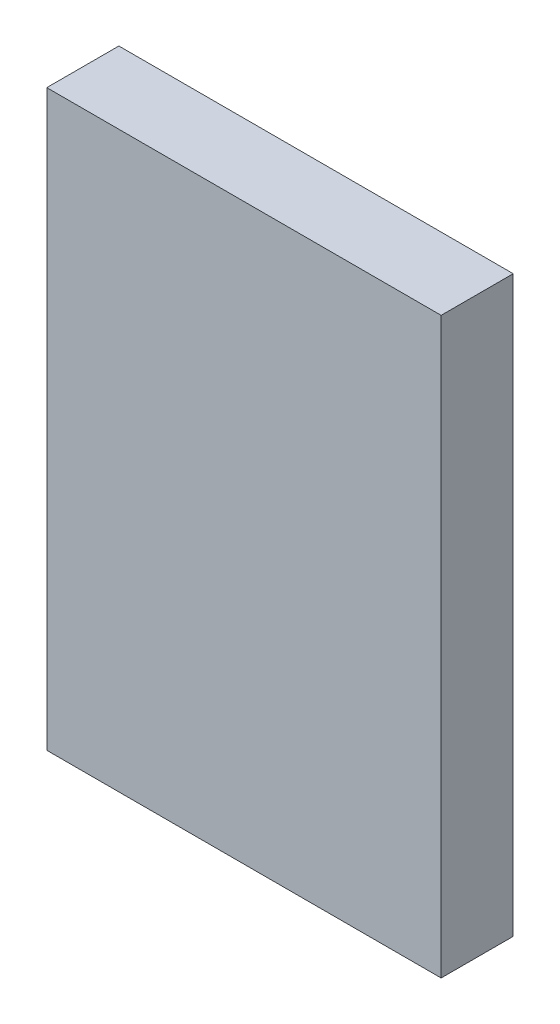
ISO-10303-21;
HEADER;
FILE_DESCRIPTION(('STEP AP214'),'2;1');
FILE_NAME('part.step','',(''),(''),'','','');
FILE_SCHEMA(('AUTOMOTIVE_DESIGN { 1 0 10303 214 1 1 1 1 }'));
ENDSEC;
DATA;
#1=APPLICATION_CONTEXT('core data for automotive mechanical design processes');
#2=APPLICATION_PROTOCOL_DEFINITION('international standard','automotive_design',2000,#1);
#3=PRODUCT_CONTEXT('',#1,'mechanical');
#4=PRODUCT('Part','Part','',(#3));
#5=PRODUCT_RELATED_PRODUCT_CATEGORY('part','',(#4));
#6=PRODUCT_DEFINITION_FORMATION('','',#4);
#7=PRODUCT_DEFINITION_CONTEXT('part definition',#1,'design');
#8=PRODUCT_DEFINITION('design','',#6,#7);
#9=PRODUCT_DEFINITION_SHAPE('','',#8);
#10=(LENGTH_UNIT() NAMED_UNIT(*) SI_UNIT(.MILLI.,.METRE.));
#11=(NAMED_UNIT(*) PLANE_ANGLE_UNIT() SI_UNIT($,.RADIAN.));
#12=(NAMED_UNIT(*) SI_UNIT($,.STERADIAN.) SOLID_ANGLE_UNIT());
#13=UNCERTAINTY_MEASURE_WITH_UNIT(LENGTH_MEASURE(1.E-05),#10,'distance_accuracy_value','');
#14=(GEOMETRIC_REPRESENTATION_CONTEXT(3) GLOBAL_UNCERTAINTY_ASSIGNED_CONTEXT((#13)) GLOBAL_UNIT_ASSIGNED_CONTEXT((#10,
#11,#12)) REPRESENTATION_CONTEXT('',''));
#15=CARTESIAN_POINT('',(0.,0.,0.));
#16=DIRECTION('',(0.,0.,1.));
#17=DIRECTION('',(1.,0.,0.));
#18=AXIS2_PLACEMENT_3D('',#15,#16,#17);
#19=CARTESIAN_POINT('',(-1.054,-1.549,0.));
#20=DIRECTION('',(0.,-1.,0.));
#21=DIRECTION('',(0.,0.,-1.));
#22=AXIS2_PLACEMENT_3D('',#19,#20,#21);
#23=PLANE('',#22);
#24=DIRECTION('',(-1.,0.,0.));
#25=VECTOR('',#24,1.);
#26=CARTESIAN_POINT('',(-0.775,-1.549,0.));
#27=LINE('',#26,#25);
#28=CARTESIAN_POINT('',(-0.775,-1.549,0.));
#29=VERTEX_POINT('',#28);
#30=CARTESIAN_POINT('',(-1.054,-1.549,0.));
#31=VERTEX_POINT('',#30);
#32=EDGE_CURVE('E11',#29,#31,#27,.T.);
#33=ORIENTED_EDGE('',*,*,#32,.F.);
#34=DIRECTION('',(0.,0.,-1.));
#35=VECTOR('',#34,1.);
#36=CARTESIAN_POINT('',(-0.775,-1.549,0.051));
#37=LINE('',#36,#35);
#38=CARTESIAN_POINT('',(-0.775,-1.549,0.051));
#39=VERTEX_POINT('',#38);
#40=EDGE_CURVE('E24',#39,#29,#37,.T.);
#41=ORIENTED_EDGE('',*,*,#40,.F.);
#42=DIRECTION('',(1.,0.,0.));
#43=VECTOR('',#42,1.);
#44=CARTESIAN_POINT('',(-1.054,-1.549,0.051));
#45=LINE('',#44,#43);
#46=CARTESIAN_POINT('',(-1.054,-1.549,0.051));
#47=VERTEX_POINT('',#46);
#48=EDGE_CURVE('E88',#47,#39,#45,.T.);
#49=ORIENTED_EDGE('',*,*,#48,.F.);
#50=DIRECTION('',(0.,0.,1.));
#51=VECTOR('',#50,1.);
#52=CARTESIAN_POINT('',(-1.054,-1.549,0.));
#53=LINE('',#52,#51);
#54=EDGE_CURVE('E77',#31,#47,#53,.T.);
#55=ORIENTED_EDGE('',*,*,#54,.F.);
#56=EDGE_LOOP('',(#33,#41,#49,#55));
#57=FACE_BOUND('',#56,.T.);
#58=ADVANCED_FACE('F17',(#57),#23,.T.);
#59=CARTESIAN_POINT('',(-0.775,-1.549,0.));
#60=DIRECTION('',(1.,0.,0.));
#61=DIRECTION('',(0.,1.,0.));
#62=AXIS2_PLACEMENT_3D('',#59,#60,#61);
#63=PLANE('',#62);
#64=DIRECTION('',(0.,-1.,0.));
#65=VECTOR('',#64,1.);
#66=CARTESIAN_POINT('',(-0.775,-1.143,0.));
#67=LINE('',#66,#65);
#68=CARTESIAN_POINT('',(-0.775,-1.143,0.));
#69=VERTEX_POINT('',#68);
#70=EDGE_CURVE('E85',#69,#29,#67,.T.);
#71=ORIENTED_EDGE('',*,*,#70,.F.);
#72=DIRECTION('',(0.,0.,-1.));
#73=VECTOR('',#72,1.);
#74=CARTESIAN_POINT('',(-0.775,-1.143,0.051));
#75=LINE('',#74,#73);
#76=CARTESIAN_POINT('',(-0.775,-1.143,0.051));
#77=VERTEX_POINT('',#76);
#78=EDGE_CURVE('E83',#77,#69,#75,.T.);
#79=ORIENTED_EDGE('',*,*,#78,.F.);
#80=DIRECTION('',(0.,1.,0.));
#81=VECTOR('',#80,1.);
#82=CARTESIAN_POINT('',(-0.775,-1.549,0.051));
#83=LINE('',#82,#81);
#84=EDGE_CURVE('E72',#39,#77,#83,.T.);
#85=ORIENTED_EDGE('',*,*,#84,.F.);
#86=ORIENTED_EDGE('',*,*,#40,.T.);
#87=EDGE_LOOP('',(#71,#79,#85,#86));
#88=FACE_BOUND('',#87,.T.);
#89=ADVANCED_FACE('F90',(#88),#63,.T.);
#90=CARTESIAN_POINT('',(-0.775,-1.143,0.));
#91=DIRECTION('',(0.,1.,0.));
#92=DIRECTION('',(1.,0.,0.));
#93=AXIS2_PLACEMENT_3D('',#90,#91,#92);
#94=PLANE('',#93);
#95=DIRECTION('',(1.,0.,0.));
#96=VECTOR('',#95,1.);
#97=CARTESIAN_POINT('',(-1.054,-1.143,0.));
#98=LINE('',#97,#96);
#99=CARTESIAN_POINT('',(-1.054,-1.143,0.));
#100=VERTEX_POINT('',#99);
#101=EDGE_CURVE('E60',#100,#69,#98,.T.);
#102=ORIENTED_EDGE('',*,*,#101,.F.);
#103=DIRECTION('',(0.,0.,-1.));
#104=VECTOR('',#103,1.);
#105=CARTESIAN_POINT('',(-1.054,-1.143,0.051));
#106=LINE('',#105,#104);
#107=CARTESIAN_POINT('',(-1.054,-1.143,0.051));
#108=VERTEX_POINT('',#107);
#109=EDGE_CURVE('E54',#108,#100,#106,.T.);
#110=ORIENTED_EDGE('',*,*,#109,.F.);
#111=DIRECTION('',(-1.,0.,0.));
#112=VECTOR('',#111,1.);
#113=CARTESIAN_POINT('',(-0.775,-1.143,0.051));
#114=LINE('',#113,#112);
#115=EDGE_CURVE('E58',#77,#108,#114,.T.);
#116=ORIENTED_EDGE('',*,*,#115,.F.);
#117=ORIENTED_EDGE('',*,*,#78,.T.);
#118=EDGE_LOOP('',(#102,#110,#116,#117));
#119=FACE_BOUND('',#118,.T.);
#120=ADVANCED_FACE('F56',(#119),#94,.T.);
#121=CARTESIAN_POINT('',(-1.054,-1.143,0.));
#122=DIRECTION('',(-1.,0.,0.));
#123=DIRECTION('',(0.,0.,1.));
#124=AXIS2_PLACEMENT_3D('',#121,#122,#123);
#125=PLANE('',#124);
#126=DIRECTION('',(0.,1.,0.));
#127=VECTOR('',#126,1.);
#128=CARTESIAN_POINT('',(-1.054,-1.549,0.));
#129=LINE('',#128,#127);
#130=EDGE_CURVE('E73',#31,#100,#129,.T.);
#131=ORIENTED_EDGE('',*,*,#130,.F.);
#132=ORIENTED_EDGE('',*,*,#54,.T.);
#133=DIRECTION('',(0.,-1.,0.));
#134=VECTOR('',#133,1.);
#135=CARTESIAN_POINT('',(-1.054,-1.143,0.051));
#136=LINE('',#135,#134);
#137=EDGE_CURVE('E70',#108,#47,#136,.T.);
#138=ORIENTED_EDGE('',*,*,#137,.F.);
#139=ORIENTED_EDGE('',*,*,#109,.T.);
#140=EDGE_LOOP('',(#131,#132,#138,#139));
#141=FACE_BOUND('',#140,.T.);
#142=ADVANCED_FACE('F76',(#141),#125,.T.);
#143=CARTESIAN_POINT('',(-1.054,-1.143,0.));
#144=DIRECTION('',(0.,0.,-1.));
#145=DIRECTION('',(0.,-1.,0.));
#146=AXIS2_PLACEMENT_3D('',#143,#144,#145);
#147=PLANE('',#146);
#148=ORIENTED_EDGE('',*,*,#101,.T.);
#149=ORIENTED_EDGE('',*,*,#70,.T.);
#150=ORIENTED_EDGE('',*,*,#32,.T.);
#151=ORIENTED_EDGE('',*,*,#130,.T.);
#152=EDGE_LOOP('',(#148,#149,#150,#151));
#153=FACE_BOUND('',#152,.T.);
#154=ADVANCED_FACE('F91',(#153),#147,.T.);
#155=CARTESIAN_POINT('',(-1.054,-1.549,0.051));
#156=DIRECTION('',(0.,0.,1.));
#157=DIRECTION('',(1.,0.,0.));
#158=AXIS2_PLACEMENT_3D('',#155,#156,#157);
#159=PLANE('',#158);
#160=ORIENTED_EDGE('',*,*,#48,.T.);
#161=ORIENTED_EDGE('',*,*,#84,.T.);
#162=ORIENTED_EDGE('',*,*,#115,.T.);
#163=ORIENTED_EDGE('',*,*,#137,.T.);
#164=EDGE_LOOP('',(#160,#161,#162,#163));
#165=FACE_BOUND('',#164,.T.);
#166=ADVANCED_FACE('F69',(#165),#159,.T.);
#167=CLOSED_SHELL('',(#58,#89,#120,#142,#154,#166));
#168=MANIFOLD_SOLID_BREP('B1',#167);
#169=ADVANCED_BREP_SHAPE_REPRESENTATION('',(#18,#168),#14);
#170=SHAPE_DEFINITION_REPRESENTATION(#9,#169);
ENDSEC;
END-ISO-10303-21;
